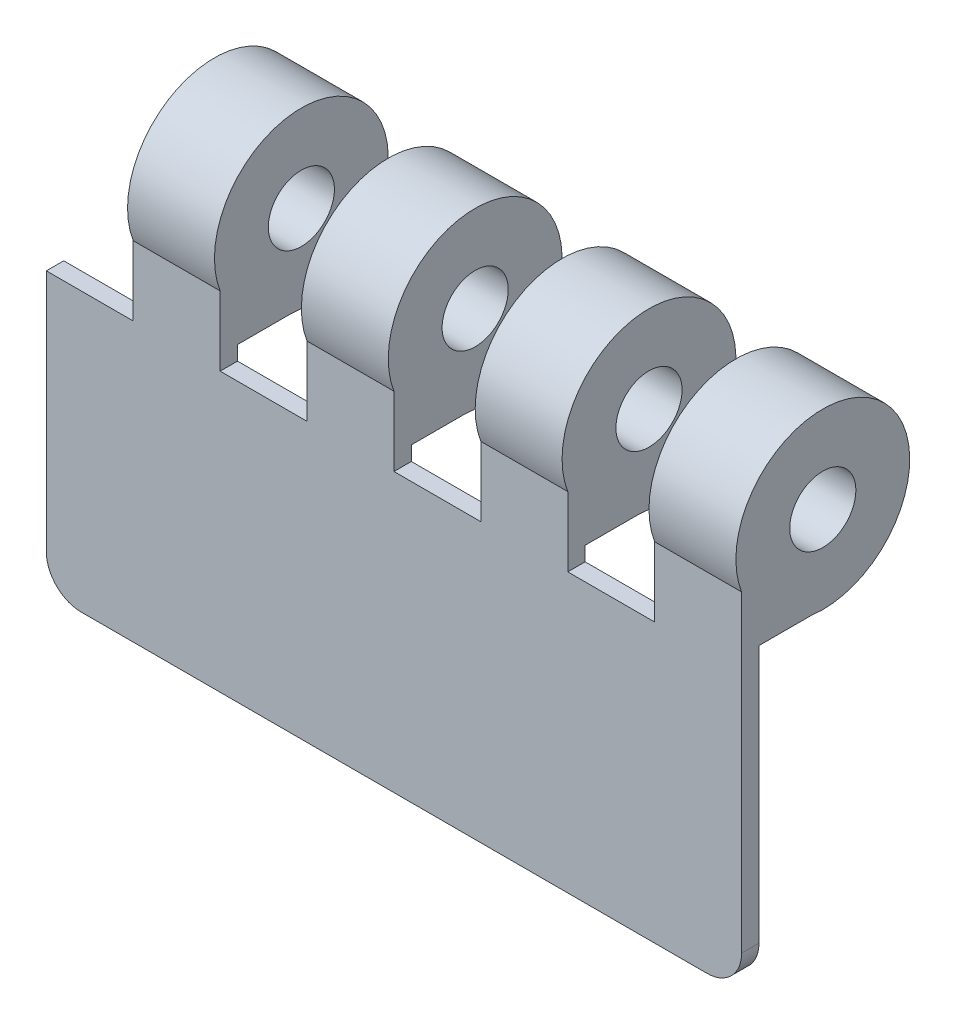
ISO-10303-21;
HEADER;
FILE_DESCRIPTION(('STEP AP214'),'2;1');
FILE_NAME('part.step','',(''),(''),'','','');
FILE_SCHEMA(('AUTOMOTIVE_DESIGN { 1 0 10303 214 1 1 1 1 }'));
ENDSEC;
DATA;
#1=APPLICATION_CONTEXT('core data for automotive mechanical design processes');
#2=APPLICATION_PROTOCOL_DEFINITION('international standard','automotive_design',2000,#1);
#3=PRODUCT_CONTEXT('',#1,'mechanical');
#4=PRODUCT('Part','Part','',(#3));
#5=PRODUCT_RELATED_PRODUCT_CATEGORY('part','',(#4));
#6=PRODUCT_DEFINITION_FORMATION('','',#4);
#7=PRODUCT_DEFINITION_CONTEXT('part definition',#1,'design');
#8=PRODUCT_DEFINITION('design','',#6,#7);
#9=PRODUCT_DEFINITION_SHAPE('','',#8);
#10=(LENGTH_UNIT() NAMED_UNIT(*) SI_UNIT(.MILLI.,.METRE.));
#11=(NAMED_UNIT(*) PLANE_ANGLE_UNIT() SI_UNIT($,.RADIAN.));
#12=(NAMED_UNIT(*) SI_UNIT($,.STERADIAN.) SOLID_ANGLE_UNIT());
#13=UNCERTAINTY_MEASURE_WITH_UNIT(LENGTH_MEASURE(1.E-05),#10,'distance_accuracy_value','');
#14=(GEOMETRIC_REPRESENTATION_CONTEXT(3) GLOBAL_UNCERTAINTY_ASSIGNED_CONTEXT((#13)) GLOBAL_UNIT_ASSIGNED_CONTEXT((#10,
#11,#12)) REPRESENTATION_CONTEXT('',''));
#15=CARTESIAN_POINT('',(0.,0.,0.));
#16=DIRECTION('',(0.,0.,1.));
#17=DIRECTION('',(1.,0.,0.));
#18=AXIS2_PLACEMENT_3D('',#15,#16,#17);
#19=CARTESIAN_POINT('',(-25.4,-12.7,5.08));
#20=DIRECTION('',(1.,0.,0.));
#21=DIRECTION('',(0.,0.,-1.));
#22=AXIS2_PLACEMENT_3D('',#19,#20,#21);
#23=PLANE('',#22);
#24=DIRECTION('',(0.,1.,0.));
#25=VECTOR('',#24,1.);
#26=CARTESIAN_POINT('',(-25.4,-12.7,3.81));
#27=LINE('',#26,#25);
#28=CARTESIAN_POINT('',(-25.4,-10.16,3.81));
#29=VERTEX_POINT('',#28);
#30=CARTESIAN_POINT('',(-25.4,7.62,3.81));
#31=VERTEX_POINT('',#30);
#32=EDGE_CURVE('E347',#29,#31,#27,.T.);
#33=ORIENTED_EDGE('',*,*,#32,.F.);
#34=DIRECTION('',(0.,0.,-1.));
#35=VECTOR('',#34,1.);
#36=CARTESIAN_POINT('',(-25.4,-10.16,5.08));
#37=LINE('',#36,#35);
#38=CARTESIAN_POINT('',(-25.4,-10.16,5.08));
#39=VERTEX_POINT('',#38);
#40=EDGE_CURVE('E61',#29,#39,#37,.F.);
#41=ORIENTED_EDGE('',*,*,#40,.T.);
#42=DIRECTION('',(0.,-1.,0.));
#43=VECTOR('',#42,1.);
#44=CARTESIAN_POINT('',(-25.4,-12.7,5.08));
#45=LINE('',#44,#43);
#46=CARTESIAN_POINT('',(-25.4,7.62,5.08));
#47=VERTEX_POINT('',#46);
#48=EDGE_CURVE('E314',#47,#39,#45,.T.);
#49=ORIENTED_EDGE('',*,*,#48,.F.);
#50=DIRECTION('',(0.,0.,1.));
#51=VECTOR('',#50,1.);
#52=CARTESIAN_POINT('',(-25.4,7.62,0.));
#53=LINE('',#52,#51);
#54=EDGE_CURVE('E273',#31,#47,#53,.T.);
#55=ORIENTED_EDGE('',*,*,#54,.F.);
#56=EDGE_LOOP('',(#33,#41,#49,#55));
#57=FACE_BOUND('',#56,.T.);
#58=ADVANCED_FACE('F37',(#57),#23,.F.);
#59=CARTESIAN_POINT('',(25.4,-12.7,5.08));
#60=DIRECTION('',(-1.,0.,0.));
#61=DIRECTION('',(0.,0.,1.));
#62=AXIS2_PLACEMENT_3D('',#59,#60,#61);
#63=PLANE('',#62);
#64=CARTESIAN_POINT('',(25.4,14.9609263592252,-0.853861474466753));
#65=DIRECTION('',(1.,0.,0.));
#66=DIRECTION('',(0.,0.,-1.));
#67=AXIS2_PLACEMENT_3D('',#64,#65,#66);
#68=CIRCLE('',#67,2.41678865840971);
#69=CARTESIAN_POINT('',(25.4,14.9609263592252,-3.27065013287646));
#70=VERTEX_POINT('',#69);
#71=EDGE_CURVE('E430',#70,#70,#68,.T.);
#72=ORIENTED_EDGE('',*,*,#71,.F.);
#73=EDGE_LOOP('',(#72));
#74=FACE_BOUND('',#73,.T.);
#75=DIRECTION('',(0.,1.,0.));
#76=VECTOR('',#75,1.);
#77=CARTESIAN_POINT('',(25.4,-12.7,5.08));
#78=LINE('',#77,#76);
#79=CARTESIAN_POINT('',(25.4,-10.16,5.08));
#80=VERTEX_POINT('',#79);
#81=CARTESIAN_POINT('',(25.4,12.7,5.08));
#82=VERTEX_POINT('',#81);
#83=EDGE_CURVE('E306',#80,#82,#78,.T.);
#84=ORIENTED_EDGE('',*,*,#83,.F.);
#85=DIRECTION('',(0.,0.,-1.));
#86=VECTOR('',#85,1.);
#87=CARTESIAN_POINT('',(25.4,-10.16,5.08));
#88=LINE('',#87,#86);
#89=CARTESIAN_POINT('',(25.4,-10.16,3.81));
#90=VERTEX_POINT('',#89);
#91=EDGE_CURVE('E11',#80,#90,#88,.T.);
#92=ORIENTED_EDGE('',*,*,#91,.T.);
#93=DIRECTION('',(0.,-1.,0.));
#94=VECTOR('',#93,1.);
#95=CARTESIAN_POINT('',(25.4,8.66859606096354,3.81));
#96=LINE('',#95,#94);
#97=CARTESIAN_POINT('',(25.4,8.66859606096354,3.81));
#98=VERTEX_POINT('',#97);
#99=EDGE_CURVE('E355',#98,#90,#96,.T.);
#100=ORIENTED_EDGE('',*,*,#99,.F.);
#101=DIRECTION('',(0.,0.,-1.));
#102=VECTOR('',#101,1.);
#103=CARTESIAN_POINT('',(25.4,8.66859606096354,3.81));
#104=LINE('',#103,#102);
#105=CARTESIAN_POINT('',(25.4,8.66859606096354,0.));
#106=VERTEX_POINT('',#105);
#107=EDGE_CURVE('E397',#98,#106,#104,.T.);
#108=ORIENTED_EDGE('',*,*,#107,.T.);
#109=CARTESIAN_POINT('',(25.4,14.9609263592252,-0.853861474466753));
#110=DIRECTION('',(1.,0.,0.));
#111=DIRECTION('',(0.,0.,-1.));
#112=AXIS2_PLACEMENT_3D('',#109,#110,#111);
#113=CIRCLE('',#112,6.35);
#114=EDGE_CURVE('E302',#106,#82,#113,.T.);
#115=ORIENTED_EDGE('',*,*,#114,.T.);
#116=EDGE_LOOP('',(#84,#92,#100,#108,#115));
#117=FACE_BOUND('',#116,.T.);
#118=ADVANCED_FACE('F407',(#74,#117),#63,.F.);
#119=CARTESIAN_POINT('',(-25.4,-12.7,5.08));
#120=DIRECTION('',(0.,1.,0.));
#121=DIRECTION('',(0.,0.,1.));
#122=AXIS2_PLACEMENT_3D('',#119,#120,#121);
#123=PLANE('',#122);
#124=DIRECTION('',(1.,0.,0.));
#125=VECTOR('',#124,1.);
#126=CARTESIAN_POINT('',(-25.4,-12.7,5.08));
#127=LINE('',#126,#125);
#128=CARTESIAN_POINT('',(-22.86,-12.7,5.08));
#129=VERTEX_POINT('',#128);
#130=CARTESIAN_POINT('',(22.86,-12.7,5.08));
#131=VERTEX_POINT('',#130);
#132=EDGE_CURVE('E317',#129,#131,#127,.T.);
#133=ORIENTED_EDGE('',*,*,#132,.F.);
#134=DIRECTION('',(0.,0.,-1.));
#135=VECTOR('',#134,1.);
#136=CARTESIAN_POINT('',(-22.86,-12.7,5.08));
#137=LINE('',#136,#135);
#138=CARTESIAN_POINT('',(-22.86,-12.7,3.81));
#139=VERTEX_POINT('',#138);
#140=EDGE_CURVE('E327',#129,#139,#137,.T.);
#141=ORIENTED_EDGE('',*,*,#140,.T.);
#142=DIRECTION('',(-1.,0.,0.));
#143=VECTOR('',#142,1.);
#144=CARTESIAN_POINT('',(25.4,-12.7,3.81));
#145=LINE('',#144,#143);
#146=CARTESIAN_POINT('',(22.86,-12.7,3.81));
#147=VERTEX_POINT('',#146);
#148=EDGE_CURVE('E349',#147,#139,#145,.T.);
#149=ORIENTED_EDGE('',*,*,#148,.F.);
#150=DIRECTION('',(0.,0.,-1.));
#151=VECTOR('',#150,1.);
#152=CARTESIAN_POINT('',(22.86,-12.7,5.08));
#153=LINE('',#152,#151);
#154=EDGE_CURVE('E325',#147,#131,#153,.F.);
#155=ORIENTED_EDGE('',*,*,#154,.T.);
#156=EDGE_LOOP('',(#133,#141,#149,#155));
#157=FACE_BOUND('',#156,.T.);
#158=ADVANCED_FACE('F343',(#157),#123,.F.);
#159=CARTESIAN_POINT('',(0.,0.,5.08));
#160=DIRECTION('',(0.,0.,-1.));
#161=DIRECTION('',(-1.,0.,0.));
#162=AXIS2_PLACEMENT_3D('',#159,#160,#161);
#163=PLANE('',#162);
#164=ORIENTED_EDGE('',*,*,#48,.T.);
#165=CARTESIAN_POINT('',(-22.86,-10.16,5.08));
#166=DIRECTION('',(0.,0.,-1.));
#167=DIRECTION('',(-1.,0.,0.));
#168=AXIS2_PLACEMENT_3D('',#165,#166,#167);
#169=CIRCLE('',#168,2.54);
#170=EDGE_CURVE('E46',#39,#129,#169,.F.);
#171=ORIENTED_EDGE('',*,*,#170,.T.);
#172=ORIENTED_EDGE('',*,*,#132,.T.);
#173=CARTESIAN_POINT('',(22.86,-10.16,5.08));
#174=DIRECTION('',(0.,0.,-1.));
#175=DIRECTION('',(-1.,0.,0.));
#176=AXIS2_PLACEMENT_3D('',#173,#174,#175);
#177=CIRCLE('',#176,2.54);
#178=EDGE_CURVE('E53',#131,#80,#177,.F.);
#179=ORIENTED_EDGE('',*,*,#178,.T.);
#180=ORIENTED_EDGE('',*,*,#83,.T.);
#181=DIRECTION('',(-1.,0.,0.));
#182=VECTOR('',#181,1.);
#183=CARTESIAN_POINT('',(-25.4,12.7,5.08));
#184=LINE('',#183,#182);
#185=CARTESIAN_POINT('',(19.05,12.7,5.08));
#186=VERTEX_POINT('',#185);
#187=EDGE_CURVE('E311',#82,#186,#184,.T.);
#188=ORIENTED_EDGE('',*,*,#187,.T.);
#189=DIRECTION('',(0.,1.,0.));
#190=VECTOR('',#189,1.);
#191=CARTESIAN_POINT('',(19.05,7.62,5.08));
#192=LINE('',#191,#190);
#193=CARTESIAN_POINT('',(19.05,7.62,5.08));
#194=VERTEX_POINT('',#193);
#195=EDGE_CURVE('E240',#194,#186,#192,.T.);
#196=ORIENTED_EDGE('',*,*,#195,.F.);
#197=DIRECTION('',(1.,0.,0.));
#198=VECTOR('',#197,1.);
#199=CARTESIAN_POINT('',(12.7,7.62,5.08));
#200=LINE('',#199,#198);
#201=CARTESIAN_POINT('',(12.7,7.62,5.08));
#202=VERTEX_POINT('',#201);
#203=EDGE_CURVE('E227',#202,#194,#200,.T.);
#204=ORIENTED_EDGE('',*,*,#203,.F.);
#205=DIRECTION('',(0.,1.,0.));
#206=VECTOR('',#205,1.);
#207=CARTESIAN_POINT('',(12.7,7.62,5.08));
#208=LINE('',#207,#206);
#209=CARTESIAN_POINT('',(12.7,12.7,5.08));
#210=VERTEX_POINT('',#209);
#211=EDGE_CURVE('E239',#202,#210,#208,.T.);
#212=ORIENTED_EDGE('',*,*,#211,.T.);
#213=DIRECTION('',(1.,0.,0.));
#214=VECTOR('',#213,1.);
#215=CARTESIAN_POINT('',(6.34999999999999,12.7,5.08));
#216=LINE('',#215,#214);
#217=CARTESIAN_POINT('',(6.34999999999999,12.7,5.08));
#218=VERTEX_POINT('',#217);
#219=EDGE_CURVE('E297',#210,#218,#216,.F.);
#220=ORIENTED_EDGE('',*,*,#219,.T.);
#221=DIRECTION('',(0.,1.,0.));
#222=VECTOR('',#221,1.);
#223=CARTESIAN_POINT('',(6.34999999999999,7.62,5.08));
#224=LINE('',#223,#222);
#225=CARTESIAN_POINT('',(6.34999999999999,7.62,5.08));
#226=VERTEX_POINT('',#225);
#227=EDGE_CURVE('E230',#226,#218,#224,.T.);
#228=ORIENTED_EDGE('',*,*,#227,.F.);
#229=DIRECTION('',(1.,0.,0.));
#230=VECTOR('',#229,1.);
#231=CARTESIAN_POINT('',(0.,7.62,5.08));
#232=LINE('',#231,#230);
#233=CARTESIAN_POINT('',(0.,7.62,5.08));
#234=VERTEX_POINT('',#233);
#235=EDGE_CURVE('E264',#234,#226,#232,.T.);
#236=ORIENTED_EDGE('',*,*,#235,.F.);
#237=DIRECTION('',(0.,1.,0.));
#238=VECTOR('',#237,1.);
#239=CARTESIAN_POINT('',(0.,7.62,5.08));
#240=LINE('',#239,#238);
#241=CARTESIAN_POINT('',(0.,12.7,5.08));
#242=VERTEX_POINT('',#241);
#243=EDGE_CURVE('E233',#234,#242,#240,.T.);
#244=ORIENTED_EDGE('',*,*,#243,.T.);
#245=CARTESIAN_POINT('',(-6.35000000000001,12.7,5.08));
#246=VERTEX_POINT('',#245);
#247=EDGE_CURVE('E315',#242,#246,#184,.T.);
#248=ORIENTED_EDGE('',*,*,#247,.T.);
#249=DIRECTION('',(0.,1.,0.));
#250=VECTOR('',#249,1.);
#251=CARTESIAN_POINT('',(-6.35000000000001,7.62,5.08));
#252=LINE('',#251,#250);
#253=CARTESIAN_POINT('',(-6.35000000000001,7.62,5.08));
#254=VERTEX_POINT('',#253);
#255=EDGE_CURVE('E254',#254,#246,#252,.T.);
#256=ORIENTED_EDGE('',*,*,#255,.F.);
#257=DIRECTION('',(1.,0.,0.));
#258=VECTOR('',#257,1.);
#259=CARTESIAN_POINT('',(-12.7,7.62,5.08));
#260=LINE('',#259,#258);
#261=CARTESIAN_POINT('',(-12.7,7.62,5.08));
#262=VERTEX_POINT('',#261);
#263=EDGE_CURVE('E250',#262,#254,#260,.T.);
#264=ORIENTED_EDGE('',*,*,#263,.F.);
#265=DIRECTION('',(0.,1.,0.));
#266=VECTOR('',#265,1.);
#267=CARTESIAN_POINT('',(-12.7,7.62,5.08));
#268=LINE('',#267,#266);
#269=CARTESIAN_POINT('',(-12.7,12.7,5.08));
#270=VERTEX_POINT('',#269);
#271=EDGE_CURVE('E253',#262,#270,#268,.T.);
#272=ORIENTED_EDGE('',*,*,#271,.T.);
#273=CARTESIAN_POINT('',(-19.05,12.7,5.08));
#274=VERTEX_POINT('',#273);
#275=EDGE_CURVE('E310',#270,#274,#184,.T.);
#276=ORIENTED_EDGE('',*,*,#275,.T.);
#277=DIRECTION('',(0.,1.,0.));
#278=VECTOR('',#277,1.);
#279=CARTESIAN_POINT('',(-19.05,7.62,5.08));
#280=LINE('',#279,#278);
#281=CARTESIAN_POINT('',(-19.05,7.62,5.08));
#282=VERTEX_POINT('',#281);
#283=EDGE_CURVE('E262',#282,#274,#280,.T.);
#284=ORIENTED_EDGE('',*,*,#283,.F.);
#285=DIRECTION('',(1.,0.,0.));
#286=VECTOR('',#285,1.);
#287=CARTESIAN_POINT('',(-25.4,7.62,5.08));
#288=LINE('',#287,#286);
#289=EDGE_CURVE('E256',#47,#282,#288,.T.);
#290=ORIENTED_EDGE('',*,*,#289,.F.);
#291=EDGE_LOOP('',(#164,#171,#172,#179,#180,#188,#196,#204,#212,#220,#228,#236,#244,#248,#256,
#264,#272,#276,#284,#290));
#292=FACE_BOUND('',#291,.T.);
#293=ADVANCED_FACE('F338',(#292),#163,.F.);
#294=CARTESIAN_POINT('',(19.05,14.9609263592252,-0.853861474466753));
#295=DIRECTION('',(1.,0.,0.));
#296=DIRECTION('',(0.,0.,-1.));
#297=AXIS2_PLACEMENT_3D('',#294,#295,#296);
#298=CYLINDRICAL_SURFACE('',#297,6.35);
#299=ORIENTED_EDGE('',*,*,#187,.F.);
#300=ORIENTED_EDGE('',*,*,#114,.F.);
#301=DIRECTION('',(1.,0.,0.));
#302=VECTOR('',#301,1.);
#303=CARTESIAN_POINT('',(19.05,8.66859606096354,0.));
#304=LINE('',#303,#302);
#305=CARTESIAN_POINT('',(19.05,8.66859606096354,0.));
#306=VERTEX_POINT('',#305);
#307=EDGE_CURVE('E319',#106,#306,#304,.F.);
#308=ORIENTED_EDGE('',*,*,#307,.T.);
#309=CARTESIAN_POINT('',(19.05,14.9609263592252,-0.853861474466753));
#310=DIRECTION('',(1.,0.,0.));
#311=DIRECTION('',(0.,0.,-1.));
#312=AXIS2_PLACEMENT_3D('',#309,#310,#311);
#313=CIRCLE('',#312,6.35);
#314=EDGE_CURVE('E303',#306,#186,#313,.T.);
#315=ORIENTED_EDGE('',*,*,#314,.T.);
#316=EDGE_LOOP('',(#299,#300,#308,#315));
#317=FACE_BOUND('',#316,.T.);
#318=ADVANCED_FACE('F406',(#317),#298,.T.);
#319=CARTESIAN_POINT('',(19.05,14.9609263592252,-0.853861474466753));
#320=DIRECTION('',(1.,0.,0.));
#321=DIRECTION('',(0.,0.,-1.));
#322=AXIS2_PLACEMENT_3D('',#319,#320,#321);
#323=PLANE('',#322);
#324=CARTESIAN_POINT('',(19.05,14.9609263592252,-0.853861474466753));
#325=DIRECTION('',(1.,0.,0.));
#326=DIRECTION('',(0.,0.,-1.));
#327=AXIS2_PLACEMENT_3D('',#324,#325,#326);
#328=CIRCLE('',#327,2.41678865840971);
#329=CARTESIAN_POINT('',(19.05,14.9609263592252,-3.27065013287646));
#330=VERTEX_POINT('',#329);
#331=EDGE_CURVE('E215',#330,#330,#328,.T.);
#332=ORIENTED_EDGE('',*,*,#331,.T.);
#333=EDGE_LOOP('',(#332));
#334=FACE_BOUND('',#333,.T.);
#335=ORIENTED_EDGE('',*,*,#314,.F.);
#336=DIRECTION('',(0.,0.,-1.));
#337=VECTOR('',#336,1.);
#338=CARTESIAN_POINT('',(19.05,8.66859606096354,3.81));
#339=LINE('',#338,#337);
#340=CARTESIAN_POINT('',(19.05,8.66859606096354,3.81));
#341=VERTEX_POINT('',#340);
#342=EDGE_CURVE('E222',#341,#306,#339,.T.);
#343=ORIENTED_EDGE('',*,*,#342,.F.);
#344=DIRECTION('',(0.,1.,0.));
#345=VECTOR('',#344,1.);
#346=CARTESIAN_POINT('',(19.05,7.62,3.81));
#347=LINE('',#346,#345);
#348=CARTESIAN_POINT('',(19.05,7.62,3.81));
#349=VERTEX_POINT('',#348);
#350=EDGE_CURVE('E207',#349,#341,#347,.T.);
#351=ORIENTED_EDGE('',*,*,#350,.F.);
#352=DIRECTION('',(0.,0.,-1.));
#353=VECTOR('',#352,1.);
#354=CARTESIAN_POINT('',(19.05,7.62,5.08));
#355=LINE('',#354,#353);
#356=EDGE_CURVE('E220',#194,#349,#355,.T.);
#357=ORIENTED_EDGE('',*,*,#356,.F.);
#358=ORIENTED_EDGE('',*,*,#195,.T.);
#359=EDGE_LOOP('',(#335,#343,#351,#357,#358));
#360=FACE_BOUND('',#359,.T.);
#361=ADVANCED_FACE('F219',(#334,#360),#323,.F.);
#362=CARTESIAN_POINT('',(6.34999999999999,14.9609263592252,-0.853861474466753));
#363=DIRECTION('',(1.,0.,0.));
#364=DIRECTION('',(0.,0.,-1.));
#365=AXIS2_PLACEMENT_3D('',#362,#363,#364);
#366=CYLINDRICAL_SURFACE('',#365,6.35);
#367=ORIENTED_EDGE('',*,*,#219,.F.);
#368=CARTESIAN_POINT('',(12.7,14.9609263592252,-0.853861474466753));
#369=DIRECTION('',(1.,0.,0.));
#370=DIRECTION('',(0.,0.,-1.));
#371=AXIS2_PLACEMENT_3D('',#368,#369,#370);
#372=CIRCLE('',#371,6.35);
#373=CARTESIAN_POINT('',(12.7,8.66859606096354,0.));
#374=VERTEX_POINT('',#373);
#375=EDGE_CURVE('E293',#374,#210,#372,.T.);
#376=ORIENTED_EDGE('',*,*,#375,.F.);
#377=DIRECTION('',(1.,0.,0.));
#378=VECTOR('',#377,1.);
#379=CARTESIAN_POINT('',(6.34999999999999,8.66859606096354,0.));
#380=LINE('',#379,#378);
#381=CARTESIAN_POINT('',(6.34999999999999,8.66859606096354,0.));
#382=VERTEX_POINT('',#381);
#383=EDGE_CURVE('E322',#374,#382,#380,.F.);
#384=ORIENTED_EDGE('',*,*,#383,.T.);
#385=CARTESIAN_POINT('',(6.34999999999999,14.9609263592252,-0.853861474466753));
#386=DIRECTION('',(1.,0.,0.));
#387=DIRECTION('',(0.,0.,-1.));
#388=AXIS2_PLACEMENT_3D('',#385,#386,#387);
#389=CIRCLE('',#388,6.35);
#390=EDGE_CURVE('E294',#382,#218,#389,.T.);
#391=ORIENTED_EDGE('',*,*,#390,.T.);
#392=EDGE_LOOP('',(#367,#376,#384,#391));
#393=FACE_BOUND('',#392,.T.);
#394=ADVANCED_FACE('F546',(#393),#366,.T.);
#395=CARTESIAN_POINT('',(6.34999999999999,14.9609263592252,-0.853861474466753));
#396=DIRECTION('',(1.,0.,0.));
#397=DIRECTION('',(0.,0.,-1.));
#398=AXIS2_PLACEMENT_3D('',#395,#396,#397);
#399=PLANE('',#398);
#400=CARTESIAN_POINT('',(6.34999999999999,14.9609263592252,-0.853861474466753));
#401=DIRECTION('',(1.,0.,0.));
#402=DIRECTION('',(0.,0.,-1.));
#403=AXIS2_PLACEMENT_3D('',#400,#401,#402);
#404=CIRCLE('',#403,2.41678865840971);
#405=CARTESIAN_POINT('',(6.34999999999999,14.9609263592252,-3.27065013287646));
#406=VERTEX_POINT('',#405);
#407=EDGE_CURVE('E415',#406,#406,#404,.T.);
#408=ORIENTED_EDGE('',*,*,#407,.T.);
#409=EDGE_LOOP('',(#408));
#410=FACE_BOUND('',#409,.T.);
#411=ORIENTED_EDGE('',*,*,#390,.F.);
#412=DIRECTION('',(0.,0.,-1.));
#413=VECTOR('',#412,1.);
#414=CARTESIAN_POINT('',(6.34999999999999,8.66859606096354,3.81));
#415=LINE('',#414,#413);
#416=CARTESIAN_POINT('',(6.34999999999999,8.66859606096354,3.81));
#417=VERTEX_POINT('',#416);
#418=EDGE_CURVE('E386',#417,#382,#415,.T.);
#419=ORIENTED_EDGE('',*,*,#418,.F.);
#420=DIRECTION('',(0.,1.,0.));
#421=VECTOR('',#420,1.);
#422=CARTESIAN_POINT('',(6.34999999999999,7.62,3.81));
#423=LINE('',#422,#421);
#424=CARTESIAN_POINT('',(6.34999999999999,7.62,3.81));
#425=VERTEX_POINT('',#424);
#426=EDGE_CURVE('E378',#425,#417,#423,.T.);
#427=ORIENTED_EDGE('',*,*,#426,.F.);
#428=DIRECTION('',(0.,0.,-1.));
#429=VECTOR('',#428,1.);
#430=CARTESIAN_POINT('',(6.34999999999999,7.62,5.08));
#431=LINE('',#430,#429);
#432=EDGE_CURVE('E258',#226,#425,#431,.T.);
#433=ORIENTED_EDGE('',*,*,#432,.F.);
#434=ORIENTED_EDGE('',*,*,#227,.T.);
#435=EDGE_LOOP('',(#411,#419,#427,#433,#434));
#436=FACE_BOUND('',#435,.T.);
#437=ADVANCED_FACE('F543',(#410,#436),#399,.F.);
#438=CARTESIAN_POINT('',(12.7,14.9609263592252,-0.853861474466753));
#439=DIRECTION('',(1.,0.,0.));
#440=DIRECTION('',(0.,0.,-1.));
#441=AXIS2_PLACEMENT_3D('',#438,#439,#440);
#442=PLANE('',#441);
#443=CARTESIAN_POINT('',(12.7,14.9609263592252,-0.853861474466753));
#444=DIRECTION('',(1.,0.,0.));
#445=DIRECTION('',(0.,0.,-1.));
#446=AXIS2_PLACEMENT_3D('',#443,#444,#445);
#447=CIRCLE('',#446,2.41678865840971);
#448=CARTESIAN_POINT('',(12.7,14.9609263592252,-3.27065013287646));
#449=VERTEX_POINT('',#448);
#450=EDGE_CURVE('E418',#449,#449,#447,.T.);
#451=ORIENTED_EDGE('',*,*,#450,.F.);
#452=EDGE_LOOP('',(#451));
#453=FACE_BOUND('',#452,.T.);
#454=DIRECTION('',(0.,0.,-1.));
#455=VECTOR('',#454,1.);
#456=CARTESIAN_POINT('',(12.7,8.66859606096354,3.81));
#457=LINE('',#456,#455);
#458=CARTESIAN_POINT('',(12.7,8.66859606096354,3.81));
#459=VERTEX_POINT('',#458);
#460=EDGE_CURVE('E248',#459,#374,#457,.T.);
#461=ORIENTED_EDGE('',*,*,#460,.T.);
#462=ORIENTED_EDGE('',*,*,#375,.T.);
#463=ORIENTED_EDGE('',*,*,#211,.F.);
#464=DIRECTION('',(0.,0.,1.));
#465=VECTOR('',#464,1.);
#466=CARTESIAN_POINT('',(12.7,7.62,0.));
#467=LINE('',#466,#465);
#468=CARTESIAN_POINT('',(12.7,7.62,3.81));
#469=VERTEX_POINT('',#468);
#470=EDGE_CURVE('E229',#469,#202,#467,.T.);
#471=ORIENTED_EDGE('',*,*,#470,.F.);
#472=DIRECTION('',(0.,-1.,0.));
#473=VECTOR('',#472,1.);
#474=CARTESIAN_POINT('',(12.7,8.66859606096354,3.81));
#475=LINE('',#474,#473);
#476=EDGE_CURVE('E211',#459,#469,#475,.T.);
#477=ORIENTED_EDGE('',*,*,#476,.F.);
#478=EDGE_LOOP('',(#461,#462,#463,#471,#477));
#479=FACE_BOUND('',#478,.T.);
#480=ADVANCED_FACE('F536',(#453,#479),#442,.T.);
#481=CARTESIAN_POINT('',(-6.35000000000001,14.9609263592252,-0.853861474466753));
#482=DIRECTION('',(1.,0.,0.));
#483=DIRECTION('',(0.,0.,-1.));
#484=AXIS2_PLACEMENT_3D('',#481,#482,#483);
#485=PLANE('',#484);
#486=CARTESIAN_POINT('',(-6.35000000000001,14.9609263592252,-0.853861474466753));
#487=DIRECTION('',(1.,0.,0.));
#488=DIRECTION('',(0.,0.,-1.));
#489=AXIS2_PLACEMENT_3D('',#486,#487,#488);
#490=CIRCLE('',#489,2.41678865840971);
#491=CARTESIAN_POINT('',(-6.35000000000001,14.9609263592252,-3.27065013287646));
#492=VERTEX_POINT('',#491);
#493=EDGE_CURVE('E421',#492,#492,#490,.T.);
#494=ORIENTED_EDGE('',*,*,#493,.T.);
#495=EDGE_LOOP('',(#494));
#496=FACE_BOUND('',#495,.T.);
#497=CARTESIAN_POINT('',(-6.35000000000001,14.9609263592252,-0.853861474466753));
#498=DIRECTION('',(1.,0.,0.));
#499=DIRECTION('',(0.,0.,-1.));
#500=AXIS2_PLACEMENT_3D('',#497,#498,#499);
#501=CIRCLE('',#500,6.35);
#502=CARTESIAN_POINT('',(-6.35000000000001,8.66859606096354,0.));
#503=VERTEX_POINT('',#502);
#504=EDGE_CURVE('E285',#503,#246,#501,.T.);
#505=ORIENTED_EDGE('',*,*,#504,.F.);
#506=DIRECTION('',(0.,0.,-1.));
#507=VECTOR('',#506,1.);
#508=CARTESIAN_POINT('',(-6.35000000000001,8.66859606096354,3.81));
#509=LINE('',#508,#507);
#510=CARTESIAN_POINT('',(-6.35000000000001,8.66859606096354,3.81));
#511=VERTEX_POINT('',#510);
#512=EDGE_CURVE('E391',#511,#503,#509,.T.);
#513=ORIENTED_EDGE('',*,*,#512,.F.);
#514=DIRECTION('',(0.,1.,0.));
#515=VECTOR('',#514,1.);
#516=CARTESIAN_POINT('',(-6.35000000000001,7.62,3.81));
#517=LINE('',#516,#515);
#518=CARTESIAN_POINT('',(-6.35000000000001,7.62,3.81));
#519=VERTEX_POINT('',#518);
#520=EDGE_CURVE('E368',#519,#511,#517,.T.);
#521=ORIENTED_EDGE('',*,*,#520,.F.);
#522=DIRECTION('',(0.,0.,-1.));
#523=VECTOR('',#522,1.);
#524=CARTESIAN_POINT('',(-6.35000000000001,7.62,5.08));
#525=LINE('',#524,#523);
#526=EDGE_CURVE('E244',#254,#519,#525,.T.);
#527=ORIENTED_EDGE('',*,*,#526,.F.);
#528=ORIENTED_EDGE('',*,*,#255,.T.);
#529=EDGE_LOOP('',(#505,#513,#521,#527,#528));
#530=FACE_BOUND('',#529,.T.);
#531=ADVANCED_FACE('F477',(#496,#530),#485,.F.);
#532=CARTESIAN_POINT('',(0.,14.9609263592252,-0.853861474466753));
#533=DIRECTION('',(1.,0.,0.));
#534=DIRECTION('',(0.,0.,-1.));
#535=AXIS2_PLACEMENT_3D('',#532,#533,#534);
#536=PLANE('',#535);
#537=CARTESIAN_POINT('',(0.,14.9609263592252,-0.853861474466753));
#538=DIRECTION('',(1.,0.,0.));
#539=DIRECTION('',(0.,0.,-1.));
#540=AXIS2_PLACEMENT_3D('',#537,#538,#539);
#541=CIRCLE('',#540,2.41678865840971);
#542=CARTESIAN_POINT('',(0.,14.9609263592252,-3.27065013287646));
#543=VERTEX_POINT('',#542);
#544=EDGE_CURVE('E424',#543,#543,#541,.T.);
#545=ORIENTED_EDGE('',*,*,#544,.F.);
#546=EDGE_LOOP('',(#545));
#547=FACE_BOUND('',#546,.T.);
#548=DIRECTION('',(0.,0.,-1.));
#549=VECTOR('',#548,1.);
#550=CARTESIAN_POINT('',(0.,8.66859606096354,3.81));
#551=LINE('',#550,#549);
#552=CARTESIAN_POINT('',(0.,8.66859606096354,3.81));
#553=VERTEX_POINT('',#552);
#554=CARTESIAN_POINT('',(0.,8.66859606096354,0.));
#555=VERTEX_POINT('',#554);
#556=EDGE_CURVE('E388',#553,#555,#551,.T.);
#557=ORIENTED_EDGE('',*,*,#556,.T.);
#558=CARTESIAN_POINT('',(0.,14.9609263592252,-0.853861474466753));
#559=DIRECTION('',(1.,0.,0.));
#560=DIRECTION('',(0.,0.,-1.));
#561=AXIS2_PLACEMENT_3D('',#558,#559,#560);
#562=CIRCLE('',#561,6.35);
#563=EDGE_CURVE('E284',#555,#242,#562,.T.);
#564=ORIENTED_EDGE('',*,*,#563,.T.);
#565=ORIENTED_EDGE('',*,*,#243,.F.);
#566=DIRECTION('',(0.,0.,1.));
#567=VECTOR('',#566,1.);
#568=CARTESIAN_POINT('',(0.,7.62,0.));
#569=LINE('',#568,#567);
#570=CARTESIAN_POINT('',(0.,7.62,3.81));
#571=VERTEX_POINT('',#570);
#572=EDGE_CURVE('E261',#571,#234,#569,.T.);
#573=ORIENTED_EDGE('',*,*,#572,.F.);
#574=DIRECTION('',(0.,-1.,0.));
#575=VECTOR('',#574,1.);
#576=CARTESIAN_POINT('',(0.,8.66859606096354,3.81));
#577=LINE('',#576,#575);
#578=EDGE_CURVE('E374',#553,#571,#577,.T.);
#579=ORIENTED_EDGE('',*,*,#578,.F.);
#580=EDGE_LOOP('',(#557,#564,#565,#573,#579));
#581=FACE_BOUND('',#580,.T.);
#582=ADVANCED_FACE('F467',(#547,#581),#536,.T.);
#583=CARTESIAN_POINT('',(-6.35000000000001,14.9609263592252,-0.853861474466753));
#584=DIRECTION('',(1.,0.,0.));
#585=DIRECTION('',(0.,0.,-1.));
#586=AXIS2_PLACEMENT_3D('',#583,#584,#585);
#587=CYLINDRICAL_SURFACE('',#586,6.35);
#588=ORIENTED_EDGE('',*,*,#563,.F.);
#589=DIRECTION('',(1.,0.,0.));
#590=VECTOR('',#589,1.);
#591=CARTESIAN_POINT('',(-6.35000000000001,8.66859606096354,0.));
#592=LINE('',#591,#590);
#593=EDGE_CURVE('E288',#555,#503,#592,.F.);
#594=ORIENTED_EDGE('',*,*,#593,.T.);
#595=ORIENTED_EDGE('',*,*,#504,.T.);
#596=ORIENTED_EDGE('',*,*,#247,.F.);
#597=EDGE_LOOP('',(#588,#594,#595,#596));
#598=FACE_BOUND('',#597,.T.);
#599=ADVANCED_FACE('F464',(#598),#587,.T.);
#600=CARTESIAN_POINT('',(-19.05,14.9609263592252,-0.853861474466753));
#601=DIRECTION('',(1.,0.,0.));
#602=DIRECTION('',(0.,0.,-1.));
#603=AXIS2_PLACEMENT_3D('',#600,#601,#602);
#604=PLANE('',#603);
#605=CARTESIAN_POINT('',(-19.05,14.9609263592252,-0.853861474466753));
#606=DIRECTION('',(1.,0.,0.));
#607=DIRECTION('',(0.,0.,-1.));
#608=AXIS2_PLACEMENT_3D('',#605,#606,#607);
#609=CIRCLE('',#608,2.41678865840971);
#610=CARTESIAN_POINT('',(-19.05,14.9609263592252,-3.27065013287646));
#611=VERTEX_POINT('',#610);
#612=EDGE_CURVE('E427',#611,#611,#609,.T.);
#613=ORIENTED_EDGE('',*,*,#612,.T.);
#614=EDGE_LOOP('',(#613));
#615=FACE_BOUND('',#614,.T.);
#616=CARTESIAN_POINT('',(-19.05,14.9609263592252,-0.853861474466753));
#617=DIRECTION('',(1.,0.,0.));
#618=DIRECTION('',(0.,0.,-1.));
#619=AXIS2_PLACEMENT_3D('',#616,#617,#618);
#620=CIRCLE('',#619,6.35);
#621=CARTESIAN_POINT('',(-19.05,8.66859606096354,0.));
#622=VERTEX_POINT('',#621);
#623=EDGE_CURVE('E276',#622,#274,#620,.T.);
#624=ORIENTED_EDGE('',*,*,#623,.F.);
#625=DIRECTION('',(0.,0.,-1.));
#626=VECTOR('',#625,1.);
#627=CARTESIAN_POINT('',(-19.05,8.66859606096354,3.81));
#628=LINE('',#627,#626);
#629=CARTESIAN_POINT('',(-19.05,8.66859606096354,3.81));
#630=VERTEX_POINT('',#629);
#631=EDGE_CURVE('E396',#630,#622,#628,.T.);
#632=ORIENTED_EDGE('',*,*,#631,.F.);
#633=DIRECTION('',(0.,1.,0.));
#634=VECTOR('',#633,1.);
#635=CARTESIAN_POINT('',(-19.05,7.62,3.81));
#636=LINE('',#635,#634);
#637=CARTESIAN_POINT('',(-19.05,7.62,3.81));
#638=VERTEX_POINT('',#637);
#639=EDGE_CURVE('E353',#638,#630,#636,.T.);
#640=ORIENTED_EDGE('',*,*,#639,.F.);
#641=DIRECTION('',(0.,0.,-1.));
#642=VECTOR('',#641,1.);
#643=CARTESIAN_POINT('',(-19.05,7.62,5.08));
#644=LINE('',#643,#642);
#645=EDGE_CURVE('E270',#282,#638,#644,.T.);
#646=ORIENTED_EDGE('',*,*,#645,.F.);
#647=ORIENTED_EDGE('',*,*,#283,.T.);
#648=EDGE_LOOP('',(#624,#632,#640,#646,#647));
#649=FACE_BOUND('',#648,.T.);
#650=ADVANCED_FACE('F444',(#615,#649),#604,.F.);
#651=CARTESIAN_POINT('',(-12.7,14.9609263592252,-0.853861474466753));
#652=DIRECTION('',(1.,0.,0.));
#653=DIRECTION('',(0.,0.,-1.));
#654=AXIS2_PLACEMENT_3D('',#651,#652,#653);
#655=PLANE('',#654);
#656=CARTESIAN_POINT('',(-12.7,14.9609263592252,-0.853861474466753));
#657=DIRECTION('',(1.,0.,0.));
#658=DIRECTION('',(0.,0.,-1.));
#659=AXIS2_PLACEMENT_3D('',#656,#657,#658);
#660=CIRCLE('',#659,2.41678865840971);
#661=CARTESIAN_POINT('',(-12.7,14.9609263592252,-3.27065013287646));
#662=VERTEX_POINT('',#661);
#663=EDGE_CURVE('E41',#662,#662,#660,.T.);
#664=ORIENTED_EDGE('',*,*,#663,.F.);
#665=EDGE_LOOP('',(#664));
#666=FACE_BOUND('',#665,.T.);
#667=DIRECTION('',(0.,0.,-1.));
#668=VECTOR('',#667,1.);
#669=CARTESIAN_POINT('',(-12.7,8.66859606096354,3.81));
#670=LINE('',#669,#668);
#671=CARTESIAN_POINT('',(-12.7,8.66859606096354,3.81));
#672=VERTEX_POINT('',#671);
#673=CARTESIAN_POINT('',(-12.7,8.66859606096354,0.));
#674=VERTEX_POINT('',#673);
#675=EDGE_CURVE('E393',#672,#674,#670,.T.);
#676=ORIENTED_EDGE('',*,*,#675,.T.);
#677=CARTESIAN_POINT('',(-12.7,14.9609263592252,-0.853861474466753));
#678=DIRECTION('',(1.,0.,0.));
#679=DIRECTION('',(0.,0.,-1.));
#680=AXIS2_PLACEMENT_3D('',#677,#678,#679);
#681=CIRCLE('',#680,6.35);
#682=EDGE_CURVE('E242',#674,#270,#681,.T.);
#683=ORIENTED_EDGE('',*,*,#682,.T.);
#684=ORIENTED_EDGE('',*,*,#271,.F.);
#685=DIRECTION('',(0.,0.,1.));
#686=VECTOR('',#685,1.);
#687=CARTESIAN_POINT('',(-12.7,7.62,0.));
#688=LINE('',#687,#686);
#689=CARTESIAN_POINT('',(-12.7,7.62,3.81));
#690=VERTEX_POINT('',#689);
#691=EDGE_CURVE('E247',#690,#262,#688,.T.);
#692=ORIENTED_EDGE('',*,*,#691,.F.);
#693=DIRECTION('',(0.,-1.,0.));
#694=VECTOR('',#693,1.);
#695=CARTESIAN_POINT('',(-12.7,8.66859606096354,3.81));
#696=LINE('',#695,#694);
#697=EDGE_CURVE('E364',#672,#690,#696,.T.);
#698=ORIENTED_EDGE('',*,*,#697,.F.);
#699=EDGE_LOOP('',(#676,#683,#684,#692,#698));
#700=FACE_BOUND('',#699,.T.);
#701=ADVANCED_FACE('F440',(#666,#700),#655,.T.);
#702=CARTESIAN_POINT('',(-19.05,14.9609263592252,-0.853861474466753));
#703=DIRECTION('',(1.,0.,0.));
#704=DIRECTION('',(0.,0.,-1.));
#705=AXIS2_PLACEMENT_3D('',#702,#703,#704);
#706=CYLINDRICAL_SURFACE('',#705,6.35);
#707=ORIENTED_EDGE('',*,*,#682,.F.);
#708=DIRECTION('',(1.,0.,0.));
#709=VECTOR('',#708,1.);
#710=CARTESIAN_POINT('',(-19.05,8.66859606096354,0.));
#711=LINE('',#710,#709);
#712=EDGE_CURVE('E279',#674,#622,#711,.F.);
#713=ORIENTED_EDGE('',*,*,#712,.T.);
#714=ORIENTED_EDGE('',*,*,#623,.T.);
#715=ORIENTED_EDGE('',*,*,#275,.F.);
#716=EDGE_LOOP('',(#707,#713,#714,#715));
#717=FACE_BOUND('',#716,.T.);
#718=ADVANCED_FACE('F443',(#717),#706,.T.);
#719=CARTESIAN_POINT('',(0.,7.62,0.));
#720=DIRECTION('',(0.,1.,0.));
#721=DIRECTION('',(0.,0.,1.));
#722=AXIS2_PLACEMENT_3D('',#719,#720,#721);
#723=PLANE('',#722);
#724=DIRECTION('',(1.,0.,0.));
#725=VECTOR('',#724,1.);
#726=CARTESIAN_POINT('',(-12.7,7.62,3.81));
#727=LINE('',#726,#725);
#728=EDGE_CURVE('E366',#690,#519,#727,.T.);
#729=ORIENTED_EDGE('',*,*,#728,.F.);
#730=ORIENTED_EDGE('',*,*,#691,.T.);
#731=ORIENTED_EDGE('',*,*,#263,.T.);
#732=ORIENTED_EDGE('',*,*,#526,.T.);
#733=EDGE_LOOP('',(#729,#730,#731,#732));
#734=FACE_BOUND('',#733,.T.);
#735=ADVANCED_FACE('F479',(#734),#723,.T.);
#736=CARTESIAN_POINT('',(0.,7.62,0.));
#737=DIRECTION('',(0.,1.,0.));
#738=DIRECTION('',(0.,0.,1.));
#739=AXIS2_PLACEMENT_3D('',#736,#737,#738);
#740=PLANE('',#739);
#741=DIRECTION('',(1.,0.,0.));
#742=VECTOR('',#741,1.);
#743=CARTESIAN_POINT('',(-25.4,7.62,3.81));
#744=LINE('',#743,#742);
#745=EDGE_CURVE('E351',#31,#638,#744,.T.);
#746=ORIENTED_EDGE('',*,*,#745,.F.);
#747=ORIENTED_EDGE('',*,*,#54,.T.);
#748=ORIENTED_EDGE('',*,*,#289,.T.);
#749=ORIENTED_EDGE('',*,*,#645,.T.);
#750=EDGE_LOOP('',(#746,#747,#748,#749));
#751=FACE_BOUND('',#750,.T.);
#752=ADVANCED_FACE('F481',(#751),#740,.T.);
#753=CARTESIAN_POINT('',(0.,7.62,0.));
#754=DIRECTION('',(0.,1.,0.));
#755=DIRECTION('',(0.,0.,1.));
#756=AXIS2_PLACEMENT_3D('',#753,#754,#755);
#757=PLANE('',#756);
#758=DIRECTION('',(1.,0.,0.));
#759=VECTOR('',#758,1.);
#760=CARTESIAN_POINT('',(0.,7.62,3.81));
#761=LINE('',#760,#759);
#762=EDGE_CURVE('E376',#571,#425,#761,.T.);
#763=ORIENTED_EDGE('',*,*,#762,.F.);
#764=ORIENTED_EDGE('',*,*,#572,.T.);
#765=ORIENTED_EDGE('',*,*,#235,.T.);
#766=ORIENTED_EDGE('',*,*,#432,.T.);
#767=EDGE_LOOP('',(#763,#764,#765,#766));
#768=FACE_BOUND('',#767,.T.);
#769=ADVANCED_FACE('F487',(#768),#757,.T.);
#770=CARTESIAN_POINT('',(0.,7.62,0.));
#771=DIRECTION('',(0.,1.,0.));
#772=DIRECTION('',(0.,0.,1.));
#773=AXIS2_PLACEMENT_3D('',#770,#771,#772);
#774=PLANE('',#773);
#775=DIRECTION('',(1.,0.,0.));
#776=VECTOR('',#775,1.);
#777=CARTESIAN_POINT('',(12.7,7.62,3.81));
#778=LINE('',#777,#776);
#779=EDGE_CURVE('E202',#469,#349,#778,.T.);
#780=ORIENTED_EDGE('',*,*,#779,.F.);
#781=ORIENTED_EDGE('',*,*,#470,.T.);
#782=ORIENTED_EDGE('',*,*,#203,.T.);
#783=ORIENTED_EDGE('',*,*,#356,.T.);
#784=EDGE_LOOP('',(#780,#781,#782,#783));
#785=FACE_BOUND('',#784,.T.);
#786=ADVANCED_FACE('F225',(#785),#774,.T.);
#787=CARTESIAN_POINT('',(6.34999999999999,8.66859606096354,3.81));
#788=DIRECTION('',(0.,1.,0.));
#789=DIRECTION('',(0.,0.,1.));
#790=AXIS2_PLACEMENT_3D('',#787,#788,#789);
#791=PLANE('',#790);
#792=ORIENTED_EDGE('',*,*,#383,.F.);
#793=ORIENTED_EDGE('',*,*,#460,.F.);
#794=DIRECTION('',(1.,0.,0.));
#795=VECTOR('',#794,1.);
#796=CARTESIAN_POINT('',(6.34999999999999,8.66859606096354,3.81));
#797=LINE('',#796,#795);
#798=EDGE_CURVE('E381',#417,#459,#797,.T.);
#799=ORIENTED_EDGE('',*,*,#798,.F.);
#800=ORIENTED_EDGE('',*,*,#418,.T.);
#801=EDGE_LOOP('',(#792,#793,#799,#800));
#802=FACE_BOUND('',#801,.T.);
#803=ADVANCED_FACE('F516',(#802),#791,.F.);
#804=CARTESIAN_POINT('',(-6.35000000000001,8.66859606096354,3.81));
#805=DIRECTION('',(0.,1.,0.));
#806=DIRECTION('',(0.,0.,1.));
#807=AXIS2_PLACEMENT_3D('',#804,#805,#806);
#808=PLANE('',#807);
#809=ORIENTED_EDGE('',*,*,#593,.F.);
#810=ORIENTED_EDGE('',*,*,#556,.F.);
#811=DIRECTION('',(1.,0.,0.));
#812=VECTOR('',#811,1.);
#813=CARTESIAN_POINT('',(-6.35000000000001,8.66859606096354,3.81));
#814=LINE('',#813,#812);
#815=EDGE_CURVE('E371',#511,#553,#814,.T.);
#816=ORIENTED_EDGE('',*,*,#815,.F.);
#817=ORIENTED_EDGE('',*,*,#512,.T.);
#818=EDGE_LOOP('',(#809,#810,#816,#817));
#819=FACE_BOUND('',#818,.T.);
#820=ADVANCED_FACE('F471',(#819),#808,.F.);
#821=CARTESIAN_POINT('',(-19.05,8.66859606096354,3.81));
#822=DIRECTION('',(0.,1.,0.));
#823=DIRECTION('',(0.,0.,1.));
#824=AXIS2_PLACEMENT_3D('',#821,#822,#823);
#825=PLANE('',#824);
#826=ORIENTED_EDGE('',*,*,#712,.F.);
#827=ORIENTED_EDGE('',*,*,#675,.F.);
#828=DIRECTION('',(1.,0.,0.));
#829=VECTOR('',#828,1.);
#830=CARTESIAN_POINT('',(-19.05,8.66859606096354,3.81));
#831=LINE('',#830,#829);
#832=EDGE_CURVE('E361',#630,#672,#831,.T.);
#833=ORIENTED_EDGE('',*,*,#832,.F.);
#834=ORIENTED_EDGE('',*,*,#631,.T.);
#835=EDGE_LOOP('',(#826,#827,#833,#834));
#836=FACE_BOUND('',#835,.T.);
#837=ADVANCED_FACE('F511',(#836),#825,.F.);
#838=CARTESIAN_POINT('',(19.05,8.66859606096354,3.81));
#839=DIRECTION('',(0.,1.,0.));
#840=DIRECTION('',(0.,0.,1.));
#841=AXIS2_PLACEMENT_3D('',#838,#839,#840);
#842=PLANE('',#841);
#843=ORIENTED_EDGE('',*,*,#307,.F.);
#844=ORIENTED_EDGE('',*,*,#107,.F.);
#845=DIRECTION('',(1.,0.,0.));
#846=VECTOR('',#845,1.);
#847=CARTESIAN_POINT('',(19.05,8.66859606096354,3.81));
#848=LINE('',#847,#846);
#849=EDGE_CURVE('E223',#341,#98,#848,.T.);
#850=ORIENTED_EDGE('',*,*,#849,.F.);
#851=ORIENTED_EDGE('',*,*,#342,.T.);
#852=EDGE_LOOP('',(#843,#844,#850,#851));
#853=FACE_BOUND('',#852,.T.);
#854=ADVANCED_FACE('F403',(#853),#842,.F.);
#855=CARTESIAN_POINT('',(0.,0.,3.81));
#856=DIRECTION('',(0.,0.,1.));
#857=DIRECTION('',(1.,0.,0.));
#858=AXIS2_PLACEMENT_3D('',#855,#856,#857);
#859=PLANE('',#858);
#860=ORIENTED_EDGE('',*,*,#148,.T.);
#861=CARTESIAN_POINT('',(-22.86,-10.16,3.81));
#862=DIRECTION('',(0.,0.,1.));
#863=DIRECTION('',(1.,0.,0.));
#864=AXIS2_PLACEMENT_3D('',#861,#862,#863);
#865=CIRCLE('',#864,2.54);
#866=EDGE_CURVE('E332',#139,#29,#865,.F.);
#867=ORIENTED_EDGE('',*,*,#866,.T.);
#868=ORIENTED_EDGE('',*,*,#32,.T.);
#869=ORIENTED_EDGE('',*,*,#745,.T.);
#870=ORIENTED_EDGE('',*,*,#639,.T.);
#871=ORIENTED_EDGE('',*,*,#832,.T.);
#872=ORIENTED_EDGE('',*,*,#697,.T.);
#873=ORIENTED_EDGE('',*,*,#728,.T.);
#874=ORIENTED_EDGE('',*,*,#520,.T.);
#875=ORIENTED_EDGE('',*,*,#815,.T.);
#876=ORIENTED_EDGE('',*,*,#578,.T.);
#877=ORIENTED_EDGE('',*,*,#762,.T.);
#878=ORIENTED_EDGE('',*,*,#426,.T.);
#879=ORIENTED_EDGE('',*,*,#798,.T.);
#880=ORIENTED_EDGE('',*,*,#476,.T.);
#881=ORIENTED_EDGE('',*,*,#779,.T.);
#882=ORIENTED_EDGE('',*,*,#350,.T.);
#883=ORIENTED_EDGE('',*,*,#849,.T.);
#884=ORIENTED_EDGE('',*,*,#99,.T.);
#885=CARTESIAN_POINT('',(22.86,-10.16,3.81));
#886=DIRECTION('',(0.,0.,1.));
#887=DIRECTION('',(1.,0.,0.));
#888=AXIS2_PLACEMENT_3D('',#885,#886,#887);
#889=CIRCLE('',#888,2.54);
#890=EDGE_CURVE('E330',#90,#147,#889,.F.);
#891=ORIENTED_EDGE('',*,*,#890,.T.);
#892=EDGE_LOOP('',(#860,#867,#868,#869,#870,#871,#872,#873,#874,#875,#876,#877,#878,#879,#880,
#881,#882,#883,#884,#891));
#893=FACE_BOUND('',#892,.T.);
#894=ADVANCED_FACE('F205',(#893),#859,.F.);
#895=CARTESIAN_POINT('',(-22.86,-10.16,5.08));
#896=DIRECTION('',(0.,0.,-1.));
#897=DIRECTION('',(-1.,0.,0.));
#898=AXIS2_PLACEMENT_3D('',#895,#896,#897);
#899=CYLINDRICAL_SURFACE('',#898,2.54);
#900=ORIENTED_EDGE('',*,*,#170,.F.);
#901=ORIENTED_EDGE('',*,*,#40,.F.);
#902=ORIENTED_EDGE('',*,*,#866,.F.);
#903=ORIENTED_EDGE('',*,*,#140,.F.);
#904=EDGE_LOOP('',(#900,#901,#902,#903));
#905=FACE_BOUND('',#904,.T.);
#906=ADVANCED_FACE('F346',(#905),#899,.T.);
#907=CARTESIAN_POINT('',(22.86,-10.16,5.08));
#908=DIRECTION('',(0.,0.,-1.));
#909=DIRECTION('',(-1.,0.,0.));
#910=AXIS2_PLACEMENT_3D('',#907,#908,#909);
#911=CYLINDRICAL_SURFACE('',#910,2.54);
#912=ORIENTED_EDGE('',*,*,#178,.F.);
#913=ORIENTED_EDGE('',*,*,#154,.F.);
#914=ORIENTED_EDGE('',*,*,#890,.F.);
#915=ORIENTED_EDGE('',*,*,#91,.F.);
#916=EDGE_LOOP('',(#912,#913,#914,#915));
#917=FACE_BOUND('',#916,.T.);
#918=ADVANCED_FACE('F39',(#917),#911,.T.);
#919=CARTESIAN_POINT('',(-50.8,14.9609263592252,-0.853861474466753));
#920=DIRECTION('',(1.,0.,0.));
#921=DIRECTION('',(0.,0.,-1.));
#922=AXIS2_PLACEMENT_3D('',#919,#920,#921);
#923=CYLINDRICAL_SURFACE('',#922,2.41678865840971);
#924=ORIENTED_EDGE('',*,*,#663,.T.);
#925=EDGE_LOOP('',(#924));
#926=FACE_BOUND('',#925,.T.);
#927=ORIENTED_EDGE('',*,*,#612,.F.);
#928=EDGE_LOOP('',(#927));
#929=FACE_BOUND('',#928,.T.);
#930=ADVANCED_FACE('F437',(#926,#929),#923,.F.);
#931=ORIENTED_EDGE('',*,*,#544,.T.);
#932=EDGE_LOOP('',(#931));
#933=FACE_BOUND('',#932,.T.);
#934=ORIENTED_EDGE('',*,*,#493,.F.);
#935=EDGE_LOOP('',(#934));
#936=FACE_BOUND('',#935,.T.);
#937=ADVANCED_FACE('F634',(#933,#936),#923,.F.);
#938=ORIENTED_EDGE('',*,*,#450,.T.);
#939=EDGE_LOOP('',(#938));
#940=FACE_BOUND('',#939,.T.);
#941=ORIENTED_EDGE('',*,*,#407,.F.);
#942=EDGE_LOOP('',(#941));
#943=FACE_BOUND('',#942,.T.);
#944=ADVANCED_FACE('F642',(#940,#943),#923,.F.);
#945=ORIENTED_EDGE('',*,*,#71,.T.);
#946=EDGE_LOOP('',(#945));
#947=FACE_BOUND('',#946,.T.);
#948=ORIENTED_EDGE('',*,*,#331,.F.);
#949=EDGE_LOOP('',(#948));
#950=FACE_BOUND('',#949,.T.);
#951=ADVANCED_FACE('F515',(#947,#950),#923,.F.);
#952=CLOSED_SHELL('',(#58,#118,#158,#293,#318,#361,#394,#437,#480,#531,#582,#599,#650,#701,#718,
#735,#752,#769,#786,#803,#820,#837,#854,#894,#906,#918,#930,#937,#944,#951));
#953=MANIFOLD_SOLID_BREP('B2',#952);
#954=ADVANCED_BREP_SHAPE_REPRESENTATION('',(#18,#953),#14);
#955=SHAPE_DEFINITION_REPRESENTATION(#9,#954);
ENDSEC;
END-ISO-10303-21;
